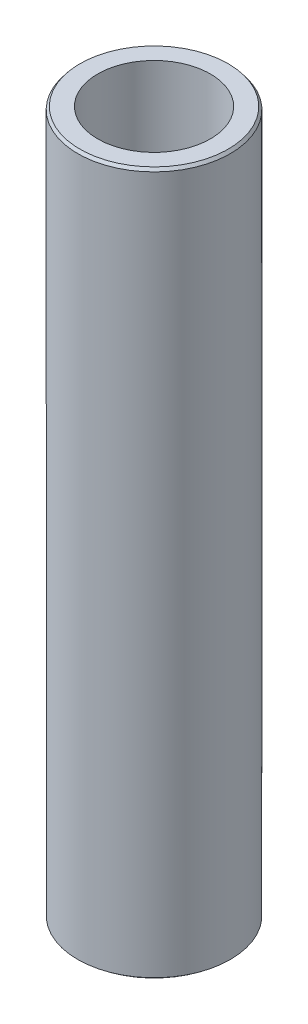
ISO-10303-21;
HEADER;
FILE_DESCRIPTION(('STEP AP214'),'2;1');
FILE_NAME('part.step','',(''),(''),'','','');
FILE_SCHEMA(('AUTOMOTIVE_DESIGN { 1 0 10303 214 1 1 1 1 }'));
ENDSEC;
DATA;
#1=APPLICATION_CONTEXT('core data for automotive mechanical design processes');
#2=APPLICATION_PROTOCOL_DEFINITION('international standard','automotive_design',2000,#1);
#3=PRODUCT_CONTEXT('',#1,'mechanical');
#4=PRODUCT('Part','Part','',(#3));
#5=PRODUCT_RELATED_PRODUCT_CATEGORY('part','',(#4));
#6=PRODUCT_DEFINITION_FORMATION('','',#4);
#7=PRODUCT_DEFINITION_CONTEXT('part definition',#1,'design');
#8=PRODUCT_DEFINITION('design','',#6,#7);
#9=PRODUCT_DEFINITION_SHAPE('','',#8);
#10=(LENGTH_UNIT() NAMED_UNIT(*) SI_UNIT(.MILLI.,.METRE.));
#11=(NAMED_UNIT(*) PLANE_ANGLE_UNIT() SI_UNIT($,.RADIAN.));
#12=(NAMED_UNIT(*) SI_UNIT($,.STERADIAN.) SOLID_ANGLE_UNIT());
#13=UNCERTAINTY_MEASURE_WITH_UNIT(LENGTH_MEASURE(1.E-05),#10,'distance_accuracy_value','');
#14=(GEOMETRIC_REPRESENTATION_CONTEXT(3) GLOBAL_UNCERTAINTY_ASSIGNED_CONTEXT((#13)) GLOBAL_UNIT_ASSIGNED_CONTEXT((#10,
#11,#12)) REPRESENTATION_CONTEXT('',''));
#15=CARTESIAN_POINT('',(0.,0.,0.));
#16=DIRECTION('',(0.,0.,1.));
#17=DIRECTION('',(1.,0.,0.));
#18=AXIS2_PLACEMENT_3D('',#15,#16,#17);
#19=CARTESIAN_POINT('',(0.,460.708989954324,0.));
#20=DIRECTION('',(0.,-1.,0.));
#21=DIRECTION('',(0.,0.,-1.));
#22=AXIS2_PLACEMENT_3D('',#19,#20,#21);
#23=CYLINDRICAL_SURFACE('',#22,50.);
#24=CARTESIAN_POINT('',(0.,458.883249104832,0.));
#25=DIRECTION('',(0.,1.,0.));
#26=DIRECTION('',(0.,0.,1.));
#27=AXIS2_PLACEMENT_3D('',#24,#25,#26);
#28=CIRCLE('',#27,50.);
#29=CARTESIAN_POINT('',(0.,458.883249104832,-50.));
#30=VERTEX_POINT('',#29);
#31=EDGE_CURVE('E50',#30,#30,#28,.F.);
#32=ORIENTED_EDGE('',*,*,#31,.T.);
#33=EDGE_LOOP('',(#32));
#34=FACE_BOUND('',#33,.T.);
#35=CARTESIAN_POINT('',(0.,1.43933817195668,0.));
#36=DIRECTION('',(0.,1.,0.));
#37=DIRECTION('',(0.,0.,1.));
#38=AXIS2_PLACEMENT_3D('',#35,#36,#37);
#39=CIRCLE('',#38,50.);
#40=CARTESIAN_POINT('',(0.,1.43933817195668,50.));
#41=VERTEX_POINT('',#40);
#42=EDGE_CURVE('E51',#41,#41,#39,.T.);
#43=ORIENTED_EDGE('',*,*,#42,.T.);
#44=EDGE_LOOP('',(#43));
#45=FACE_BOUND('',#44,.T.);
#46=ADVANCED_FACE('F39',(#34,#45),#23,.T.);
#47=CARTESIAN_POINT('',(0.,460.708989954324,0.));
#48=DIRECTION('',(0.,1.,0.));
#49=DIRECTION('',(0.,0.,1.));
#50=AXIS2_PLACEMENT_3D('',#47,#48,#49);
#51=PLANE('',#50);
#52=CARTESIAN_POINT('',(0.,460.708989954324,0.));
#53=DIRECTION('',(0.,1.,0.));
#54=DIRECTION('',(0.,0.,1.));
#55=AXIS2_PLACEMENT_3D('',#52,#53,#54);
#56=CIRCLE('',#55,48.5606618280434);
#57=CARTESIAN_POINT('',(0.,460.708989954324,-48.5606618280434));
#58=VERTEX_POINT('',#57);
#59=EDGE_CURVE('E54',#58,#58,#56,.T.);
#60=ORIENTED_EDGE('',*,*,#59,.T.);
#61=EDGE_LOOP('',(#60));
#62=FACE_BOUND('',#61,.T.);
#63=CARTESIAN_POINT('',(0.,460.708989954324,0.));
#64=DIRECTION('',(0.,1.,0.));
#65=DIRECTION('',(0.,0.,1.));
#66=AXIS2_PLACEMENT_3D('',#63,#64,#65);
#67=CIRCLE('',#66,36.920861844583);
#68=CARTESIAN_POINT('',(0.,460.708989954324,36.920861844583));
#69=VERTEX_POINT('',#68);
#70=EDGE_CURVE('E58',#69,#69,#67,.T.);
#71=ORIENTED_EDGE('',*,*,#70,.F.);
#72=EDGE_LOOP('',(#71));
#73=FACE_BOUND('',#72,.T.);
#74=ADVANCED_FACE('F69',(#62,#73),#51,.T.);
#75=CARTESIAN_POINT('',(0.,0.,0.));
#76=DIRECTION('',(0.,1.,0.));
#77=DIRECTION('',(0.,0.,1.));
#78=AXIS2_PLACEMENT_3D('',#75,#76,#77);
#79=PLANE('',#78);
#80=CARTESIAN_POINT('',(0.,0.,0.));
#81=DIRECTION('',(0.,1.,0.));
#82=DIRECTION('',(0.,0.,1.));
#83=AXIS2_PLACEMENT_3D('',#80,#81,#82);
#84=CIRCLE('',#83,48.1742591505076);
#85=CARTESIAN_POINT('',(0.,0.,48.1742591505076));
#86=VERTEX_POINT('',#85);
#87=EDGE_CURVE('E10',#86,#86,#84,.F.);
#88=ORIENTED_EDGE('',*,*,#87,.T.);
#89=EDGE_LOOP('',(#88));
#90=FACE_BOUND('',#89,.T.);
#91=CARTESIAN_POINT('',(0.,0.,0.));
#92=DIRECTION('',(0.,1.,0.));
#93=DIRECTION('',(0.,0.,1.));
#94=AXIS2_PLACEMENT_3D('',#91,#92,#93);
#95=CIRCLE('',#94,36.920861844583);
#96=CARTESIAN_POINT('',(0.,0.,36.920861844583));
#97=VERTEX_POINT('',#96);
#98=EDGE_CURVE('E63',#97,#97,#95,.T.);
#99=ORIENTED_EDGE('',*,*,#98,.T.);
#100=EDGE_LOOP('',(#99));
#101=FACE_BOUND('',#100,.T.);
#102=ADVANCED_FACE('F75',(#90,#101),#79,.F.);
#103=CARTESIAN_POINT('',(0.,460.708989954324,0.));
#104=DIRECTION('',(0.,-1.,0.));
#105=DIRECTION('',(0.,0.,-1.));
#106=AXIS2_PLACEMENT_3D('',#103,#104,#105);
#107=CYLINDRICAL_SURFACE('',#106,36.920861844583);
#108=ORIENTED_EDGE('',*,*,#70,.T.);
#109=EDGE_LOOP('',(#108));
#110=FACE_BOUND('',#109,.T.);
#111=ORIENTED_EDGE('',*,*,#98,.F.);
#112=EDGE_LOOP('',(#111));
#113=FACE_BOUND('',#112,.T.);
#114=ADVANCED_FACE('F70',(#110,#113),#107,.F.);
#115=CARTESIAN_POINT('',(0.,460.708989954324,0.));
#116=DIRECTION('',(0.,-1.,0.));
#117=DIRECTION('',(0.,0.,-1.));
#118=AXIS2_PLACEMENT_3D('',#115,#116,#117);
#119=CONICAL_SURFACE('',#118,48.5606618280434,0.667601997823021);
#120=CARTESIAN_POINT('',(0.,458.883249104832,-50.));
#121=CARTESIAN_POINT('',(0.,458.902267238681,-49.9850068940422));
#122=CARTESIAN_POINT('',(0.,458.92128537253,-49.9700137880843));
#123=CARTESIAN_POINT('',(0.,458.959321640227,-49.9400275761685));
#124=CARTESIAN_POINT('',(0.,458.978339774076,-49.9250344702106));
#125=CARTESIAN_POINT('',(0.,459.016376041774,-49.8950482582949));
#126=CARTESIAN_POINT('',(0.,459.035394175623,-49.880055152337));
#127=CARTESIAN_POINT('',(0.,459.073430443321,-49.8500689404212));
#128=CARTESIAN_POINT('',(0.,459.09244857717,-49.8350758344633));
#129=CARTESIAN_POINT('',(0.,459.130484844867,-49.8050896225476));
#130=CARTESIAN_POINT('',(0.,459.149502978716,-49.7900965165897));
#131=CARTESIAN_POINT('',(0.,459.187539246414,-49.7601103046739));
#132=CARTESIAN_POINT('',(0.,459.206557380263,-49.745117198716));
#133=CARTESIAN_POINT('',(0.,459.244593647961,-49.7151309868003));
#134=CARTESIAN_POINT('',(0.,459.263611781809,-49.7001378808424));
#135=CARTESIAN_POINT('',(0.,459.301648049507,-49.6701516689266));
#136=CARTESIAN_POINT('',(0.,459.320666183356,-49.6551585629688));
#137=CARTESIAN_POINT('',(0.,459.358702451054,-49.625172351053));
#138=CARTESIAN_POINT('',(0.,459.377720584903,-49.6101792450951));
#139=CARTESIAN_POINT('',(0.,459.415756852601,-49.5801930331794));
#140=CARTESIAN_POINT('',(0.,459.434774986449,-49.5651999272215));
#141=CARTESIAN_POINT('',(0.,459.472811254147,-49.5352137153057));
#142=CARTESIAN_POINT('',(0.,459.491829387996,-49.5202206093478));
#143=CARTESIAN_POINT('',(0.,459.529865655694,-49.4902343974321));
#144=CARTESIAN_POINT('',(0.,459.548883789543,-49.4752412914742));
#145=CARTESIAN_POINT('',(0.,459.58692005724,-49.4452550795584));
#146=CARTESIAN_POINT('',(0.,459.605938191089,-49.4302619736006));
#147=CARTESIAN_POINT('',(0.,459.643974458787,-49.4002757616848));
#148=CARTESIAN_POINT('',(0.,459.662992592636,-49.3852826557269));
#149=CARTESIAN_POINT('',(0.,459.701028860334,-49.3552964438111));
#150=CARTESIAN_POINT('',(0.,459.720046994183,-49.3403033378533));
#151=CARTESIAN_POINT('',(0.,459.75808326188,-49.3103171259375));
#152=CARTESIAN_POINT('',(0.,459.777101395729,-49.2953240199796));
#153=CARTESIAN_POINT('',(0.,459.815137663427,-49.2653378080639));
#154=CARTESIAN_POINT('',(0.,459.834155797276,-49.250344702106));
#155=CARTESIAN_POINT('',(0.,459.872192064974,-49.2203584901902));
#156=CARTESIAN_POINT('',(0.,459.891210198823,-49.2053653842323));
#157=CARTESIAN_POINT('',(0.,459.92924646652,-49.1753791723166));
#158=CARTESIAN_POINT('',(0.,459.948264600369,-49.1603860663587));
#159=CARTESIAN_POINT('',(0.,459.986300868067,-49.1303998544429));
#160=CARTESIAN_POINT('',(0.,460.005319001916,-49.1154067484851));
#161=CARTESIAN_POINT('',(0.,460.043355269614,-49.0854205365693));
#162=CARTESIAN_POINT('',(0.,460.062373403462,-49.0704274306114));
#163=CARTESIAN_POINT('',(0.,460.10040967116,-49.0404412186956));
#164=CARTESIAN_POINT('',(0.,460.119427805009,-49.0254481127378));
#165=CARTESIAN_POINT('',(0.,460.157464072707,-48.995461900822));
#166=CARTESIAN_POINT('',(0.,460.176482206556,-48.9804687948641));
#167=CARTESIAN_POINT('',(0.,460.214518474253,-48.9504825829484));
#168=CARTESIAN_POINT('',(0.,460.233536608102,-48.9354894769905));
#169=CARTESIAN_POINT('',(0.,460.2715728758,-48.9055032650747));
#170=CARTESIAN_POINT('',(0.,460.290591009649,-48.8905101591168));
#171=CARTESIAN_POINT('',(0.,460.328627277347,-48.8605239472011));
#172=CARTESIAN_POINT('',(0.,460.347645411196,-48.8455308412432));
#173=CARTESIAN_POINT('',(0.,460.385681678893,-48.8155446293274));
#174=CARTESIAN_POINT('',(0.,460.404699812742,-48.8005515233695));
#175=CARTESIAN_POINT('',(0.,460.44273608044,-48.7705653114538));
#176=CARTESIAN_POINT('',(0.,460.461754214289,-48.7555722054959));
#177=CARTESIAN_POINT('',(0.,460.499790481987,-48.7255859935801));
#178=CARTESIAN_POINT('',(0.,460.518808615836,-48.7105928876222));
#179=CARTESIAN_POINT('',(0.,460.556844883533,-48.6806066757065));
#180=CARTESIAN_POINT('',(0.,460.575863017382,-48.6656135697486));
#181=CARTESIAN_POINT('',(0.,460.61389928508,-48.6356273578329));
#182=CARTESIAN_POINT('',(0.,460.632917418929,-48.620634251875));
#183=CARTESIAN_POINT('',(0.,460.670953686627,-48.5906480399592));
#184=CARTESIAN_POINT('',(0.,460.689971820475,-48.5756549340013));
#185=CARTESIAN_POINT('',(0.,460.708989954324,-48.5606618280434));
#186=B_SPLINE_CURVE_WITH_KNOTS('',3,(#120,#121,#122,#123,#124,#125,#126,#127,#128,#129,#130,
#131,#132,#133,#134,#135,#136,#137,#138,#139,#140,#141,#142,#143,#144,#145,#146,#147,#148,#149,
#150,#151,#152,#153,#154,#155,#156,#157,#158,#159,#160,#161,#162,#163,#164,#165,#166,#167,#168,
#169,#170,#171,#172,#173,#174,#175,#176,#177,#178,#179,#180,#181,#182,#183,#184,#185),
.UNSPECIFIED.,.F.,.F.,(4,2,2,2,2,2,2,2,2,2,2,2,2,2,2,2,2,2,2,2,2,2,2,2,2,2,2,2,2,2,2,2,4),(0.,
0.0726522110622162,0.145304422124385,0.217956633186557,0.29060884424873,0.363261055310902,
0.435913266373071,0.508565477435287,0.581217688497459,0.653869899559632,0.726522110621805,
0.799174321683973,0.871826532746146,0.944478743808362,1.01713095487053,1.08978316593271,
1.16243537699487,1.23508758805705,1.30773979911922,1.38039201018139,1.4530442212436,
1.52569643230578,1.59834864336795,1.67100085443012,1.7436530654923,1.81630527655446,
1.88895748761668,1.96160969867885,2.03426190974102,2.1069141208032,2.17956633186537,
2.25221854292754,2.32487075398975),.UNSPECIFIED.);
#187=EDGE_CURVE('BSEAM81',#30,#58,#186,.T.);
#188=ORIENTED_EDGE('',*,*,#31,.F.);
#189=ORIENTED_EDGE('',*,*,#59,.F.);
#190=ORIENTED_EDGE('',*,*,#187,.T.);
#191=ORIENTED_EDGE('',*,*,#187,.F.);
#192=EDGE_LOOP('',(#188,#190,#189,#191));
#193=FACE_BOUND('',#192,.T.);
#194=ADVANCED_FACE('F81',(#193),#119,.T.);
#195=CARTESIAN_POINT('',(0.,1.43933817195668,0.));
#196=DIRECTION('',(0.,1.,0.));
#197=DIRECTION('',(0.,0.,1.));
#198=AXIS2_PLACEMENT_3D('',#195,#196,#197);
#199=CONICAL_SURFACE('',#198,50.,0.903194328971843);
#200=ORIENTED_EDGE('',*,*,#87,.F.);
#201=EDGE_LOOP('',(#200));
#202=FACE_BOUND('',#201,.T.);
#203=ORIENTED_EDGE('',*,*,#42,.F.);
#204=EDGE_LOOP('',(#203));
#205=FACE_BOUND('',#204,.T.);
#206=ADVANCED_FACE('F45',(#202,#205),#199,.T.);
#207=CLOSED_SHELL('',(#46,#74,#102,#114,#194,#206));
#208=MANIFOLD_SOLID_BREP('B2',#207);
#209=ADVANCED_BREP_SHAPE_REPRESENTATION('',(#18,#208),#14);
#210=SHAPE_DEFINITION_REPRESENTATION(#9,#209);
ENDSEC;
END-ISO-10303-21;
